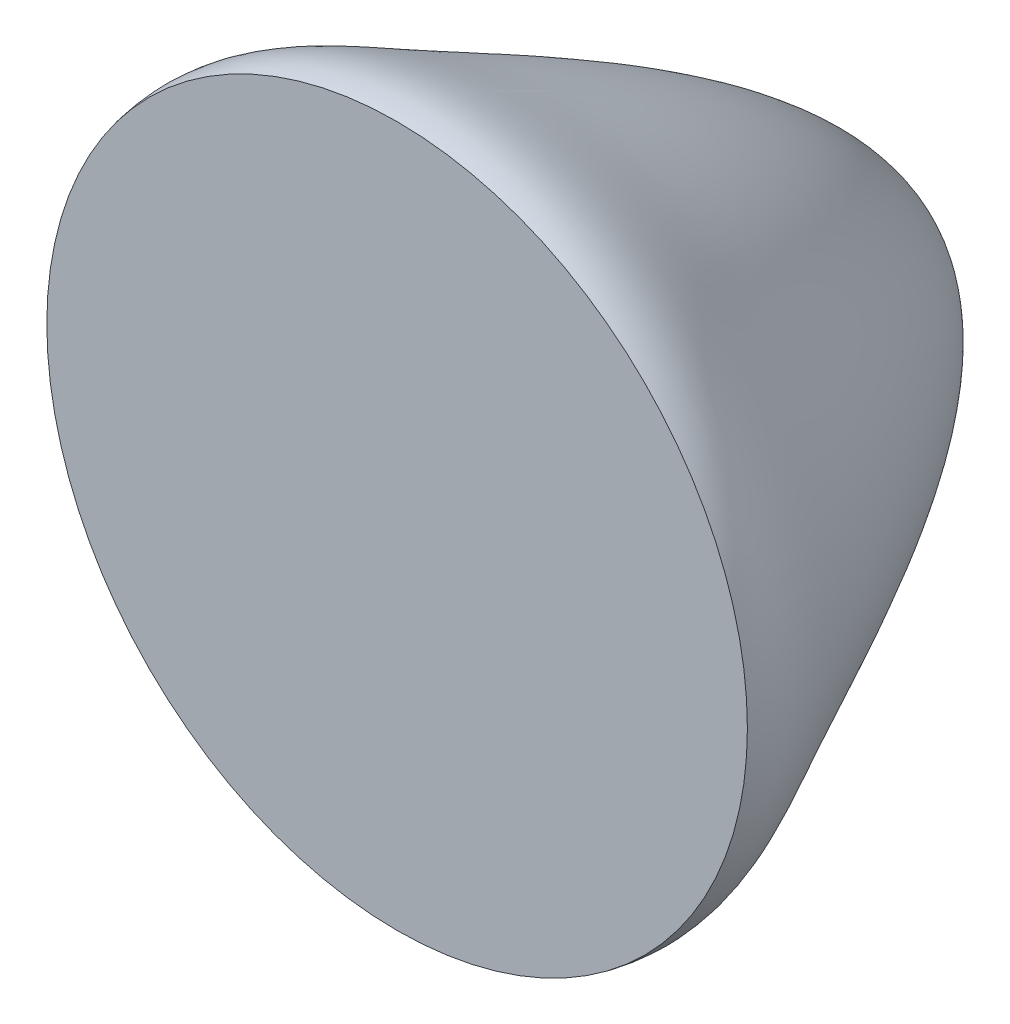
ISO-10303-21;
HEADER;
FILE_DESCRIPTION(('STEP AP214'),'2;1');
FILE_NAME('part.step','',(''),(''),'','','');
FILE_SCHEMA(('AUTOMOTIVE_DESIGN { 1 0 10303 214 1 1 1 1 }'));
ENDSEC;
DATA;
#1=APPLICATION_CONTEXT('core data for automotive mechanical design processes');
#2=APPLICATION_PROTOCOL_DEFINITION('international standard','automotive_design',2000,#1);
#3=PRODUCT_CONTEXT('',#1,'mechanical');
#4=PRODUCT('Part','Part','',(#3));
#5=PRODUCT_RELATED_PRODUCT_CATEGORY('part','',(#4));
#6=PRODUCT_DEFINITION_FORMATION('','',#4);
#7=PRODUCT_DEFINITION_CONTEXT('part definition',#1,'design');
#8=PRODUCT_DEFINITION('design','',#6,#7);
#9=PRODUCT_DEFINITION_SHAPE('','',#8);
#10=(LENGTH_UNIT() NAMED_UNIT(*) SI_UNIT(.MILLI.,.METRE.));
#11=(NAMED_UNIT(*) PLANE_ANGLE_UNIT() SI_UNIT($,.RADIAN.));
#12=(NAMED_UNIT(*) SI_UNIT($,.STERADIAN.) SOLID_ANGLE_UNIT());
#13=UNCERTAINTY_MEASURE_WITH_UNIT(LENGTH_MEASURE(1.E-05),#10,'distance_accuracy_value','');
#14=(GEOMETRIC_REPRESENTATION_CONTEXT(3) GLOBAL_UNCERTAINTY_ASSIGNED_CONTEXT((#13)) GLOBAL_UNIT_ASSIGNED_CONTEXT((#10,
#11,#12)) REPRESENTATION_CONTEXT('',''));
#15=CARTESIAN_POINT('',(0.,0.,0.));
#16=DIRECTION('',(0.,0.,1.));
#17=DIRECTION('',(1.,0.,0.));
#18=AXIS2_PLACEMENT_3D('',#15,#16,#17);
#19=CARTESIAN_POINT('',(0.,0.,-1.15));
#20=CARTESIAN_POINT('',(0.,0.319733684083505,-1.15));
#21=CARTESIAN_POINT('',(0.,0.679588811159878,-0.32165049688381));
#22=CARTESIAN_POINT('',(0.,0.821380604207943,-0.0988915868627304));
#23=CARTESIAN_POINT('',(0.,0.8,0.));
#24=B_SPLINE_CURVE_WITH_KNOTS('',3,(#19,#20,#21,#22,#23),.UNSPECIFIED.,.F.,.F.,(4,1,4),(0.,
0.634080944599834,1.),.UNSPECIFIED.);
#25=CARTESIAN_POINT('',(0.,0.,-1.15));
#26=DIRECTION('',(0.,0.,-1.));
#27=AXIS1_PLACEMENT('',#25,#26);
#28=SURFACE_OF_REVOLUTION('',#24,#27);
#29=CARTESIAN_POINT('',(0.,0.,0.));
#30=DIRECTION('',(0.,0.,-1.));
#31=DIRECTION('',(0.,1.,0.));
#32=AXIS2_PLACEMENT_3D('',#29,#30,#31);
#33=CIRCLE('',#32,0.8);
#34=CARTESIAN_POINT('',(0.,0.8,0.));
#35=VERTEX_POINT('',#34);
#36=EDGE_CURVE('E11',#35,#35,#33,.T.);
#37=ORIENTED_EDGE('',*,*,#36,.T.);
#38=EDGE_LOOP('',(#37));
#39=FACE_BOUND('',#38,.T.);
#40=CARTESIAN_POINT('',(0.,0.,-1.15));
#41=VERTEX_POINT('',#40);
#42=VERTEX_LOOP('',#41);
#43=FACE_BOUND('',#42,.T.);
#44=ADVANCED_FACE('F32',(#39,#43),#28,.F.);
#45=CARTESIAN_POINT('',(0.,0.8,0.));
#46=DIRECTION('',(0.,0.,1.));
#47=DIRECTION('',(0.,-1.,0.));
#48=AXIS2_PLACEMENT_3D('',#45,#46,#47);
#49=PLANE('',#48);
#50=ORIENTED_EDGE('',*,*,#36,.F.);
#51=EDGE_LOOP('',(#50));
#52=FACE_BOUND('',#51,.T.);
#53=ADVANCED_FACE('F41',(#52),#49,.T.);
#54=CLOSED_SHELL('',(#44,#53));
#55=MANIFOLD_SOLID_BREP('B2',#54);
#56=ADVANCED_BREP_SHAPE_REPRESENTATION('',(#18,#55),#14);
#57=SHAPE_DEFINITION_REPRESENTATION(#9,#56);
ENDSEC;
END-ISO-10303-21;
